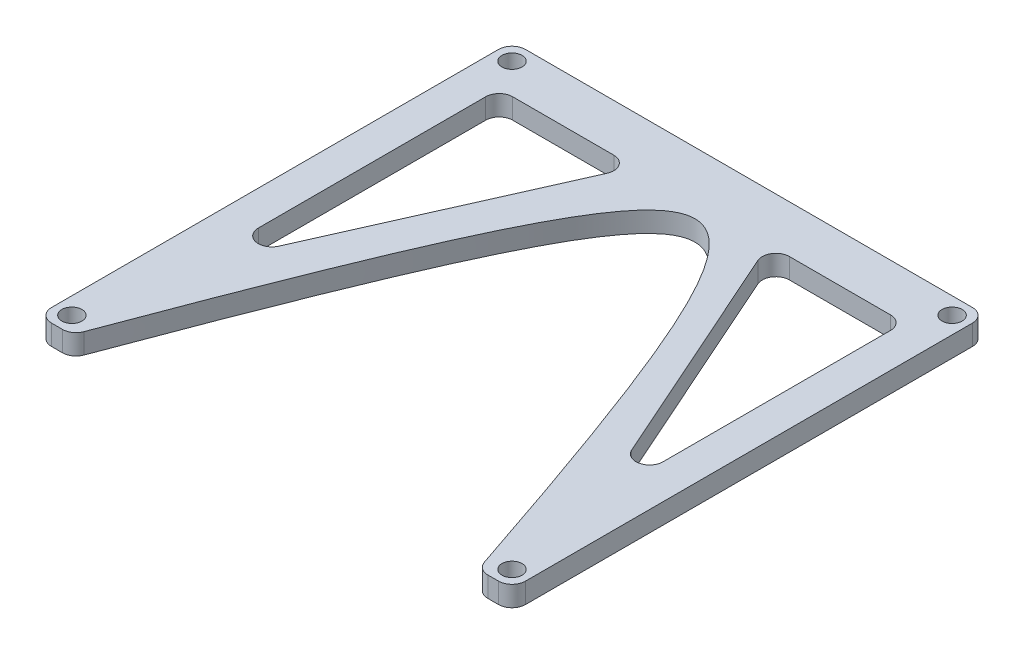
ISO-10303-21;
HEADER;
FILE_DESCRIPTION(('STEP AP214'),'2;1');
FILE_NAME('part.step','',(''),(''),'','','');
FILE_SCHEMA(('AUTOMOTIVE_DESIGN { 1 0 10303 214 1 1 1 1 }'));
ENDSEC;
DATA;
#1=APPLICATION_CONTEXT('core data for automotive mechanical design processes');
#2=APPLICATION_PROTOCOL_DEFINITION('international standard','automotive_design',2000,#1);
#3=PRODUCT_CONTEXT('',#1,'mechanical');
#4=PRODUCT('Part','Part','',(#3));
#5=PRODUCT_RELATED_PRODUCT_CATEGORY('part','',(#4));
#6=PRODUCT_DEFINITION_FORMATION('','',#4);
#7=PRODUCT_DEFINITION_CONTEXT('part definition',#1,'design');
#8=PRODUCT_DEFINITION('design','',#6,#7);
#9=PRODUCT_DEFINITION_SHAPE('','',#8);
#10=(LENGTH_UNIT() NAMED_UNIT(*) SI_UNIT(.MILLI.,.METRE.));
#11=(NAMED_UNIT(*) PLANE_ANGLE_UNIT() SI_UNIT($,.RADIAN.));
#12=(NAMED_UNIT(*) SI_UNIT($,.STERADIAN.) SOLID_ANGLE_UNIT());
#13=UNCERTAINTY_MEASURE_WITH_UNIT(LENGTH_MEASURE(1.E-05),#10,'distance_accuracy_value','');
#14=(GEOMETRIC_REPRESENTATION_CONTEXT(3) GLOBAL_UNCERTAINTY_ASSIGNED_CONTEXT((#13)) GLOBAL_UNIT_ASSIGNED_CONTEXT((#10,
#11,#12)) REPRESENTATION_CONTEXT('',''));
#15=CARTESIAN_POINT('',(0.,0.,0.));
#16=DIRECTION('',(0.,0.,1.));
#17=DIRECTION('',(1.,0.,0.));
#18=AXIS2_PLACEMENT_3D('',#15,#16,#17);
#19=CARTESIAN_POINT('',(35.,3.,35.));
#20=DIRECTION('',(0.,0.,-1.));
#21=DIRECTION('',(-1.,0.,0.));
#22=AXIS2_PLACEMENT_3D('',#19,#20,#21);
#23=PLANE('',#22);
#24=DIRECTION('',(1.,0.,0.));
#25=VECTOR('',#24,1.);
#26=CARTESIAN_POINT('',(35.,0.,35.));
#27=LINE('',#26,#25);
#28=CARTESIAN_POINT('',(31.4403017296359,0.,35.));
#29=VERTEX_POINT('',#28);
#30=CARTESIAN_POINT('',(33.,0.,35.));
#31=VERTEX_POINT('',#30);
#32=EDGE_CURVE('E223',#29,#31,#27,.T.);
#33=ORIENTED_EDGE('',*,*,#32,.T.);
#34=DIRECTION('',(0.,-1.,0.));
#35=VECTOR('',#34,1.);
#36=CARTESIAN_POINT('',(33.,3.,35.));
#37=LINE('',#36,#35);
#38=CARTESIAN_POINT('',(33.,3.,35.));
#39=VERTEX_POINT('',#38);
#40=EDGE_CURVE('E201',#31,#39,#37,.F.);
#41=ORIENTED_EDGE('',*,*,#40,.T.);
#42=DIRECTION('',(1.,0.,0.));
#43=VECTOR('',#42,1.);
#44=CARTESIAN_POINT('',(35.,3.,35.));
#45=LINE('',#44,#43);
#46=CARTESIAN_POINT('',(31.4403017296359,3.,35.));
#47=VERTEX_POINT('',#46);
#48=EDGE_CURVE('E242',#47,#39,#45,.T.);
#49=ORIENTED_EDGE('',*,*,#48,.F.);
#50=DIRECTION('',(0.,-1.,0.));
#51=VECTOR('',#50,1.);
#52=CARTESIAN_POINT('',(31.4403017296359,3.,35.));
#53=LINE('',#52,#51);
#54=EDGE_CURVE('E206',#47,#29,#53,.T.);
#55=ORIENTED_EDGE('',*,*,#54,.T.);
#56=EDGE_LOOP('',(#33,#41,#49,#55));
#57=FACE_BOUND('',#56,.T.);
#58=ADVANCED_FACE('F35',(#57),#23,.F.);
#59=CARTESIAN_POINT('',(35.,3.,-35.));
#60=DIRECTION('',(-1.,0.,0.));
#61=DIRECTION('',(0.,0.,1.));
#62=AXIS2_PLACEMENT_3D('',#59,#60,#61);
#63=PLANE('',#62);
#64=DIRECTION('',(0.,0.,-1.));
#65=VECTOR('',#64,1.);
#66=CARTESIAN_POINT('',(35.,3.,-35.));
#67=LINE('',#66,#65);
#68=CARTESIAN_POINT('',(35.,3.,33.));
#69=VERTEX_POINT('',#68);
#70=CARTESIAN_POINT('',(35.,3.,-33.));
#71=VERTEX_POINT('',#70);
#72=EDGE_CURVE('E216',#69,#71,#67,.T.);
#73=ORIENTED_EDGE('',*,*,#72,.F.);
#74=DIRECTION('',(0.,-1.,0.));
#75=VECTOR('',#74,1.);
#76=CARTESIAN_POINT('',(35.,3.,33.));
#77=LINE('',#76,#75);
#78=CARTESIAN_POINT('',(35.,0.,33.));
#79=VERTEX_POINT('',#78);
#80=EDGE_CURVE('E200',#69,#79,#77,.T.);
#81=ORIENTED_EDGE('',*,*,#80,.T.);
#82=DIRECTION('',(0.,0.,-1.));
#83=VECTOR('',#82,1.);
#84=CARTESIAN_POINT('',(35.,0.,-35.));
#85=LINE('',#84,#83);
#86=CARTESIAN_POINT('',(35.,0.,-33.));
#87=VERTEX_POINT('',#86);
#88=EDGE_CURVE('E213',#79,#87,#85,.T.);
#89=ORIENTED_EDGE('',*,*,#88,.T.);
#90=DIRECTION('',(0.,-1.,0.));
#91=VECTOR('',#90,1.);
#92=CARTESIAN_POINT('',(35.,3.,-33.));
#93=LINE('',#92,#91);
#94=EDGE_CURVE('E218',#87,#71,#93,.F.);
#95=ORIENTED_EDGE('',*,*,#94,.T.);
#96=EDGE_LOOP('',(#73,#81,#89,#95));
#97=FACE_BOUND('',#96,.T.);
#98=ADVANCED_FACE('F212',(#97),#63,.F.);
#99=CARTESIAN_POINT('',(-35.,3.,-35.));
#100=DIRECTION('',(0.,0.,1.));
#101=DIRECTION('',(1.,0.,0.));
#102=AXIS2_PLACEMENT_3D('',#99,#100,#101);
#103=PLANE('',#102);
#104=DIRECTION('',(-1.,0.,0.));
#105=VECTOR('',#104,1.);
#106=CARTESIAN_POINT('',(-35.,0.,-35.));
#107=LINE('',#106,#105);
#108=CARTESIAN_POINT('',(33.,0.,-35.));
#109=VERTEX_POINT('',#108);
#110=CARTESIAN_POINT('',(-33.,0.,-35.));
#111=VERTEX_POINT('',#110);
#112=EDGE_CURVE('E222',#109,#111,#107,.T.);
#113=ORIENTED_EDGE('',*,*,#112,.T.);
#114=DIRECTION('',(0.,-1.,0.));
#115=VECTOR('',#114,1.);
#116=CARTESIAN_POINT('',(-33.,3.,-35.));
#117=LINE('',#116,#115);
#118=CARTESIAN_POINT('',(-33.,3.,-35.));
#119=VERTEX_POINT('',#118);
#120=EDGE_CURVE('E289',#111,#119,#117,.F.);
#121=ORIENTED_EDGE('',*,*,#120,.T.);
#122=DIRECTION('',(-1.,0.,0.));
#123=VECTOR('',#122,1.);
#124=CARTESIAN_POINT('',(-35.,3.,-35.));
#125=LINE('',#124,#123);
#126=CARTESIAN_POINT('',(33.,3.,-35.));
#127=VERTEX_POINT('',#126);
#128=EDGE_CURVE('E413',#127,#119,#125,.T.);
#129=ORIENTED_EDGE('',*,*,#128,.F.);
#130=DIRECTION('',(0.,-1.,0.));
#131=VECTOR('',#130,1.);
#132=CARTESIAN_POINT('',(33.,3.,-35.));
#133=LINE('',#132,#131);
#134=EDGE_CURVE('E286',#127,#109,#133,.T.);
#135=ORIENTED_EDGE('',*,*,#134,.T.);
#136=EDGE_LOOP('',(#113,#121,#129,#135));
#137=FACE_BOUND('',#136,.T.);
#138=ADVANCED_FACE('F442',(#137),#103,.F.);
#139=CARTESIAN_POINT('',(-35.,3.,-35.));
#140=DIRECTION('',(1.,0.,0.));
#141=DIRECTION('',(0.,0.,-1.));
#142=AXIS2_PLACEMENT_3D('',#139,#140,#141);
#143=PLANE('',#142);
#144=DIRECTION('',(0.,0.,1.));
#145=VECTOR('',#144,1.);
#146=CARTESIAN_POINT('',(-35.,0.,-35.));
#147=LINE('',#146,#145);
#148=CARTESIAN_POINT('',(-35.,0.,-33.));
#149=VERTEX_POINT('',#148);
#150=CARTESIAN_POINT('',(-35.,0.,33.));
#151=VERTEX_POINT('',#150);
#152=EDGE_CURVE('E226',#149,#151,#147,.T.);
#153=ORIENTED_EDGE('',*,*,#152,.T.);
#154=DIRECTION('',(0.,-1.,0.));
#155=VECTOR('',#154,1.);
#156=CARTESIAN_POINT('',(-35.,3.,33.));
#157=LINE('',#156,#155);
#158=CARTESIAN_POINT('',(-35.,3.,33.));
#159=VERTEX_POINT('',#158);
#160=EDGE_CURVE('E284',#151,#159,#157,.F.);
#161=ORIENTED_EDGE('',*,*,#160,.T.);
#162=DIRECTION('',(0.,0.,1.));
#163=VECTOR('',#162,1.);
#164=CARTESIAN_POINT('',(-35.,3.,-35.));
#165=LINE('',#164,#163);
#166=CARTESIAN_POINT('',(-35.,3.,-33.));
#167=VERTEX_POINT('',#166);
#168=EDGE_CURVE('E416',#167,#159,#165,.T.);
#169=ORIENTED_EDGE('',*,*,#168,.F.);
#170=DIRECTION('',(0.,-1.,0.));
#171=VECTOR('',#170,1.);
#172=CARTESIAN_POINT('',(-35.,3.,-33.));
#173=LINE('',#172,#171);
#174=EDGE_CURVE('E281',#167,#149,#173,.T.);
#175=ORIENTED_EDGE('',*,*,#174,.T.);
#176=EDGE_LOOP('',(#153,#161,#169,#175));
#177=FACE_BOUND('',#176,.T.);
#178=ADVANCED_FACE('F438',(#177),#143,.F.);
#179=CARTESIAN_POINT('',(-30.,3.,35.));
#180=DIRECTION('',(0.,0.,-1.));
#181=DIRECTION('',(-1.,0.,0.));
#182=AXIS2_PLACEMENT_3D('',#179,#180,#181);
#183=PLANE('',#182);
#184=DIRECTION('',(1.,0.,0.));
#185=VECTOR('',#184,1.);
#186=CARTESIAN_POINT('',(-30.,0.,35.));
#187=LINE('',#186,#185);
#188=CARTESIAN_POINT('',(-33.,0.,35.));
#189=VERTEX_POINT('',#188);
#190=CARTESIAN_POINT('',(-31.3900685120707,0.,35.));
#191=VERTEX_POINT('',#190);
#192=EDGE_CURVE('E234',#189,#191,#187,.T.);
#193=ORIENTED_EDGE('',*,*,#192,.T.);
#194=DIRECTION('',(0.,-1.,0.));
#195=VECTOR('',#194,1.);
#196=CARTESIAN_POINT('',(-31.3900685120707,3.,35.));
#197=LINE('',#196,#195);
#198=CARTESIAN_POINT('',(-31.3900685120707,3.,35.));
#199=VERTEX_POINT('',#198);
#200=EDGE_CURVE('E279',#191,#199,#197,.F.);
#201=ORIENTED_EDGE('',*,*,#200,.T.);
#202=DIRECTION('',(1.,0.,0.));
#203=VECTOR('',#202,1.);
#204=CARTESIAN_POINT('',(-30.,3.,35.));
#205=LINE('',#204,#203);
#206=CARTESIAN_POINT('',(-33.,3.,35.));
#207=VERTEX_POINT('',#206);
#208=EDGE_CURVE('E419',#207,#199,#205,.T.);
#209=ORIENTED_EDGE('',*,*,#208,.F.);
#210=DIRECTION('',(0.,-1.,0.));
#211=VECTOR('',#210,1.);
#212=CARTESIAN_POINT('',(-33.,3.,35.));
#213=LINE('',#212,#211);
#214=EDGE_CURVE('E276',#207,#189,#213,.T.);
#215=ORIENTED_EDGE('',*,*,#214,.T.);
#216=EDGE_LOOP('',(#193,#201,#209,#215));
#217=FACE_BOUND('',#216,.T.);
#218=ADVANCED_FACE('F433',(#217),#183,.F.);
#219=CARTESIAN_POINT('',(-30.,3.,35.));
#220=CARTESIAN_POINT('',(1.60249834950404,3.,-50.0815307085895));
#221=CARTESIAN_POINT('',(30.,3.,35.));
#222=(BOUNDED_CURVE() B_SPLINE_CURVE(2,(#219,#220,#221),.UNSPECIFIED.,.F.,
.F.) B_SPLINE_CURVE_WITH_KNOTS((3,3),(0.,1.),
.UNSPECIFIED.) CURVE() GEOMETRIC_REPRESENTATION_ITEM() RATIONAL_B_SPLINE_CURVE((1.,
2.51295867918572,1.)) REPRESENTATION_ITEM(''));
#223=DIRECTION('',(0.,-1.,0.));
#224=VECTOR('',#223,1.);
#225=SURFACE_OF_LINEAR_EXTRUSION('',#222,#224);
#226=CARTESIAN_POINT('',(-30.,0.,35.));
#227=CARTESIAN_POINT('',(1.60249834950404,0.,-50.0815307085895));
#228=CARTESIAN_POINT('',(30.,0.,35.));
#229=(BOUNDED_CURVE() B_SPLINE_CURVE(2,(#226,#227,#228),.UNSPECIFIED.,.F.,
.F.) B_SPLINE_CURVE_WITH_KNOTS((3,3),(0.,1.),
.UNSPECIFIED.) CURVE() GEOMETRIC_REPRESENTATION_ITEM() RATIONAL_B_SPLINE_CURVE((1.,
2.51295867918572,1.)) REPRESENTATION_ITEM(''));
#230=CARTESIAN_POINT('',(-29.515759256809,0.,33.6978286434652));
#231=VERTEX_POINT('',#230);
#232=CARTESIAN_POINT('',(29.5437062469228,0.,33.6347641884607));
#233=VERTEX_POINT('',#232);
#234=EDGE_CURVE('E237',#231,#233,#229,.T.);
#235=ORIENTED_EDGE('',*,*,#234,.T.);
#236=DIRECTION('',(0.,-1.,0.));
#237=VECTOR('',#236,1.);
#238=CARTESIAN_POINT('',(29.5437062469228,0.,33.6347641884607));
#239=LINE('',#238,#237);
#240=CARTESIAN_POINT('',(29.5437062469228,3.,33.6347641884607));
#241=VERTEX_POINT('',#240);
#242=EDGE_CURVE('E274',#233,#241,#239,.F.);
#243=ORIENTED_EDGE('',*,*,#242,.T.);
#244=CARTESIAN_POINT('',(-29.515759256809,3.,33.6978286434652));
#245=VERTEX_POINT('',#244);
#246=EDGE_CURVE('E246',#245,#241,#222,.T.);
#247=ORIENTED_EDGE('',*,*,#246,.F.);
#248=DIRECTION('',(0.,-1.,0.));
#249=VECTOR('',#248,1.);
#250=CARTESIAN_POINT('',(-29.515759256809,3.,33.6978286434651));
#251=LINE('',#250,#249);
#252=EDGE_CURVE('E271',#245,#231,#251,.T.);
#253=ORIENTED_EDGE('',*,*,#252,.T.);
#254=EDGE_LOOP('',(#235,#243,#247,#253));
#255=FACE_BOUND('',#254,.T.);
#256=ADVANCED_FACE('F429',(#255),#225,.F.);
#257=CARTESIAN_POINT('',(1.14633062996926,3.,-25.8621935405501));
#258=DIRECTION('',(0.,1.,0.));
#259=DIRECTION('',(0.,0.,1.));
#260=AXIS2_PLACEMENT_3D('',#257,#258,#259);
#261=PLANE('',#260);
#262=DIRECTION('',(0.406138466053448,0.,-0.913811548620257));
#263=VECTOR('',#262,1.);
#264=CARTESIAN_POINT('',(-9.89161932674733,3.,-28.));
#265=LINE('',#264,#263);
#266=CARTESIAN_POINT('',(-26.0639962295068,3.,8.38784803120884));
#267=VERTEX_POINT('',#266);
#268=CARTESIAN_POINT('',(-11.1415201854615,3.,-25.1877230678931));
#269=VERTEX_POINT('',#268);
#270=EDGE_CURVE('E345',#267,#269,#265,.T.);
#271=ORIENTED_EDGE('',*,*,#270,.F.);
#272=CARTESIAN_POINT('',(-27.8916193267473,3.,7.57557109910195));
#273=DIRECTION('',(0.,1.,0.));
#274=DIRECTION('',(0.,0.,1.));
#275=AXIS2_PLACEMENT_3D('',#272,#273,#274);
#276=CIRCLE('',#275,2.);
#277=CARTESIAN_POINT('',(-29.8916193267473,3.,7.57557109910195));
#278=VERTEX_POINT('',#277);
#279=EDGE_CURVE('E332',#267,#278,#276,.F.);
#280=ORIENTED_EDGE('',*,*,#279,.T.);
#281=DIRECTION('',(0.,0.,1.));
#282=VECTOR('',#281,1.);
#283=CARTESIAN_POINT('',(-29.8916193267473,3.,17.));
#284=LINE('',#283,#282);
#285=CARTESIAN_POINT('',(-29.8916193267473,3.,-26.));
#286=VERTEX_POINT('',#285);
#287=EDGE_CURVE('E365',#286,#278,#284,.T.);
#288=ORIENTED_EDGE('',*,*,#287,.F.);
#289=CARTESIAN_POINT('',(-27.8916193267473,3.,-26.));
#290=DIRECTION('',(0.,1.,0.));
#291=DIRECTION('',(0.,0.,1.));
#292=AXIS2_PLACEMENT_3D('',#289,#290,#291);
#293=CIRCLE('',#292,2.);
#294=CARTESIAN_POINT('',(-27.8916193267473,3.,-28.));
#295=VERTEX_POINT('',#294);
#296=EDGE_CURVE('E336',#286,#295,#293,.F.);
#297=ORIENTED_EDGE('',*,*,#296,.T.);
#298=DIRECTION('',(-1.,0.,0.));
#299=VECTOR('',#298,1.);
#300=CARTESIAN_POINT('',(-29.8916193267473,3.,-28.));
#301=LINE('',#300,#299);
#302=CARTESIAN_POINT('',(-12.969143282702,3.,-28.));
#303=VERTEX_POINT('',#302);
#304=EDGE_CURVE('E346',#303,#295,#301,.T.);
#305=ORIENTED_EDGE('',*,*,#304,.F.);
#306=CARTESIAN_POINT('',(-12.969143282702,3.,-26.));
#307=DIRECTION('',(0.,1.,0.));
#308=DIRECTION('',(0.,0.,1.));
#309=AXIS2_PLACEMENT_3D('',#306,#307,#308);
#310=CIRCLE('',#309,2.);
#311=EDGE_CURVE('E43',#303,#269,#310,.F.);
#312=ORIENTED_EDGE('',*,*,#311,.T.);
#313=EDGE_LOOP('',(#271,#280,#288,#297,#305,#312));
#314=FACE_BOUND('',#313,.T.);
#315=DIRECTION('',(0.406138466053448,0.,0.913811548620257));
#316=VECTOR('',#315,1.);
#317=CARTESIAN_POINT('',(9.89161932674734,3.,-28.));
#318=LINE('',#317,#316);
#319=CARTESIAN_POINT('',(11.1415201854615,3.,-25.1877230678931));
#320=VERTEX_POINT('',#319);
#321=CARTESIAN_POINT('',(26.0639962295068,3.,8.38784803120883));
#322=VERTEX_POINT('',#321);
#323=EDGE_CURVE('E380',#320,#322,#318,.T.);
#324=ORIENTED_EDGE('',*,*,#323,.F.);
#325=CARTESIAN_POINT('',(12.969143282702,3.,-26.));
#326=DIRECTION('',(0.,1.,0.));
#327=DIRECTION('',(0.,0.,1.));
#328=AXIS2_PLACEMENT_3D('',#325,#326,#327);
#329=CIRCLE('',#328,2.);
#330=CARTESIAN_POINT('',(12.969143282702,3.,-28.));
#331=VERTEX_POINT('',#330);
#332=EDGE_CURVE('E324',#320,#331,#329,.F.);
#333=ORIENTED_EDGE('',*,*,#332,.T.);
#334=DIRECTION('',(-1.,0.,0.));
#335=VECTOR('',#334,1.);
#336=CARTESIAN_POINT('',(29.8916193267473,3.,-28.));
#337=LINE('',#336,#335);
#338=CARTESIAN_POINT('',(27.8916193267473,3.,-28.));
#339=VERTEX_POINT('',#338);
#340=EDGE_CURVE('E375',#339,#331,#337,.T.);
#341=ORIENTED_EDGE('',*,*,#340,.F.);
#342=CARTESIAN_POINT('',(27.8916193267473,3.,-26.));
#343=DIRECTION('',(0.,1.,0.));
#344=DIRECTION('',(0.,0.,1.));
#345=AXIS2_PLACEMENT_3D('',#342,#343,#344);
#346=CIRCLE('',#345,2.);
#347=CARTESIAN_POINT('',(29.8916193267473,3.,-26.));
#348=VERTEX_POINT('',#347);
#349=EDGE_CURVE('E320',#339,#348,#346,.F.);
#350=ORIENTED_EDGE('',*,*,#349,.T.);
#351=DIRECTION('',(0.,0.,-1.));
#352=VECTOR('',#351,1.);
#353=CARTESIAN_POINT('',(29.8916193267473,3.,17.));
#354=LINE('',#353,#352);
#355=CARTESIAN_POINT('',(29.8916193267473,3.,7.57557109910194));
#356=VERTEX_POINT('',#355);
#357=EDGE_CURVE('E383',#356,#348,#354,.T.);
#358=ORIENTED_EDGE('',*,*,#357,.F.);
#359=CARTESIAN_POINT('',(27.8916193267473,3.,7.57557109910193));
#360=DIRECTION('',(0.,1.,0.));
#361=DIRECTION('',(0.,0.,1.));
#362=AXIS2_PLACEMENT_3D('',#359,#360,#361);
#363=CIRCLE('',#362,2.);
#364=EDGE_CURVE('E328',#356,#322,#363,.F.);
#365=ORIENTED_EDGE('',*,*,#364,.T.);
#366=EDGE_LOOP('',(#324,#333,#341,#350,#358,#365));
#367=FACE_BOUND('',#366,.T.);
#368=CARTESIAN_POINT('',(-32.4999999999993,3.,32.5));
#369=DIRECTION('',(0.,1.,0.));
#370=DIRECTION('',(0.,0.,1.));
#371=AXIS2_PLACEMENT_3D('',#368,#369,#370);
#372=CIRCLE('',#371,1.48813384559825);
#373=CARTESIAN_POINT('',(-32.4999999999993,3.,33.9881338455983));
#374=VERTEX_POINT('',#373);
#375=EDGE_CURVE('E363',#374,#374,#372,.T.);
#376=ORIENTED_EDGE('',*,*,#375,.F.);
#377=EDGE_LOOP('',(#376));
#378=FACE_BOUND('',#377,.T.);
#379=CARTESIAN_POINT('',(32.5000000000007,3.,32.5));
#380=DIRECTION('',(0.,1.,0.));
#381=DIRECTION('',(0.,0.,1.));
#382=AXIS2_PLACEMENT_3D('',#379,#380,#381);
#383=CIRCLE('',#382,1.48813384559825);
#384=CARTESIAN_POINT('',(32.5000000000007,3.,33.9881338455983));
#385=VERTEX_POINT('',#384);
#386=EDGE_CURVE('E398',#385,#385,#383,.T.);
#387=ORIENTED_EDGE('',*,*,#386,.F.);
#388=EDGE_LOOP('',(#387));
#389=FACE_BOUND('',#388,.T.);
#390=CARTESIAN_POINT('',(32.5,3.,-32.5));
#391=DIRECTION('',(0.,1.,0.));
#392=DIRECTION('',(0.,0.,1.));
#393=AXIS2_PLACEMENT_3D('',#390,#391,#392);
#394=CIRCLE('',#393,1.48813384559825);
#395=CARTESIAN_POINT('',(32.5,3.,-31.0118661544018));
#396=VERTEX_POINT('',#395);
#397=EDGE_CURVE('E392',#396,#396,#394,.T.);
#398=ORIENTED_EDGE('',*,*,#397,.F.);
#399=EDGE_LOOP('',(#398));
#400=FACE_BOUND('',#399,.T.);
#401=CARTESIAN_POINT('',(-32.5,3.,-32.5));
#402=DIRECTION('',(0.,1.,0.));
#403=DIRECTION('',(0.,0.,1.));
#404=AXIS2_PLACEMENT_3D('',#401,#402,#403);
#405=CIRCLE('',#404,1.48813384559825);
#406=CARTESIAN_POINT('',(-32.5,3.,-31.0118661544018));
#407=VERTEX_POINT('',#406);
#408=EDGE_CURVE('E391',#407,#407,#405,.T.);
#409=ORIENTED_EDGE('',*,*,#408,.F.);
#410=EDGE_LOOP('',(#409));
#411=FACE_BOUND('',#410,.T.);
#412=ORIENTED_EDGE('',*,*,#48,.T.);
#413=CARTESIAN_POINT('',(33.,3.,33.));
#414=DIRECTION('',(0.,1.,0.));
#415=DIRECTION('',(0.,0.,1.));
#416=AXIS2_PLACEMENT_3D('',#413,#414,#415);
#417=CIRCLE('',#416,2.);
#418=EDGE_CURVE('E269',#39,#69,#417,.T.);
#419=ORIENTED_EDGE('',*,*,#418,.T.);
#420=ORIENTED_EDGE('',*,*,#72,.T.);
#421=CARTESIAN_POINT('',(33.,3.,-33.));
#422=DIRECTION('',(0.,1.,0.));
#423=DIRECTION('',(0.,0.,1.));
#424=AXIS2_PLACEMENT_3D('',#421,#422,#423);
#425=CIRCLE('',#424,2.);
#426=EDGE_CURVE('E259',#71,#127,#425,.T.);
#427=ORIENTED_EDGE('',*,*,#426,.T.);
#428=ORIENTED_EDGE('',*,*,#128,.T.);
#429=CARTESIAN_POINT('',(-33.,3.,-33.));
#430=DIRECTION('',(0.,1.,0.));
#431=DIRECTION('',(0.,0.,1.));
#432=AXIS2_PLACEMENT_3D('',#429,#430,#431);
#433=CIRCLE('',#432,2.);
#434=EDGE_CURVE('E261',#119,#167,#433,.T.);
#435=ORIENTED_EDGE('',*,*,#434,.T.);
#436=ORIENTED_EDGE('',*,*,#168,.T.);
#437=CARTESIAN_POINT('',(-33.,3.,33.));
#438=DIRECTION('',(0.,1.,0.));
#439=DIRECTION('',(0.,0.,1.));
#440=AXIS2_PLACEMENT_3D('',#437,#438,#439);
#441=CIRCLE('',#440,2.);
#442=EDGE_CURVE('E263',#159,#207,#441,.T.);
#443=ORIENTED_EDGE('',*,*,#442,.T.);
#444=ORIENTED_EDGE('',*,*,#208,.T.);
#445=CARTESIAN_POINT('',(-31.3900685120707,3.,33.));
#446=DIRECTION('',(0.,1.,0.));
#447=DIRECTION('',(0.,0.,1.));
#448=AXIS2_PLACEMENT_3D('',#445,#446,#447);
#449=CIRCLE('',#448,2.);
#450=EDGE_CURVE('E265',#199,#245,#449,.T.);
#451=ORIENTED_EDGE('',*,*,#450,.T.);
#452=ORIENTED_EDGE('',*,*,#246,.T.);
#453=CARTESIAN_POINT('',(31.4403017296359,3.,33.0000000000001));
#454=DIRECTION('',(0.,1.,0.));
#455=DIRECTION('',(0.,0.,1.));
#456=AXIS2_PLACEMENT_3D('',#453,#454,#455);
#457=CIRCLE('',#456,2.);
#458=EDGE_CURVE('E267',#241,#47,#457,.T.);
#459=ORIENTED_EDGE('',*,*,#458,.T.);
#460=EDGE_LOOP('',(#412,#419,#420,#427,#428,#435,#436,#443,#444,#451,#452,#459));
#461=FACE_BOUND('',#460,.T.);
#462=ADVANCED_FACE('F343',(#314,#367,#378,#389,#400,#411,#461),#261,.T.);
#463=CARTESIAN_POINT('',(1.14633062996926,0.,-25.8621935405501));
#464=DIRECTION('',(0.,1.,0.));
#465=DIRECTION('',(0.,0.,1.));
#466=AXIS2_PLACEMENT_3D('',#463,#464,#465);
#467=PLANE('',#466);
#468=DIRECTION('',(-1.,0.,0.));
#469=VECTOR('',#468,1.);
#470=CARTESIAN_POINT('',(-29.8916193267473,0.,-28.));
#471=LINE('',#470,#469);
#472=CARTESIAN_POINT('',(-12.969143282702,0.,-28.));
#473=VERTEX_POINT('',#472);
#474=CARTESIAN_POINT('',(-27.8916193267473,0.,-28.));
#475=VERTEX_POINT('',#474);
#476=EDGE_CURVE('E357',#473,#475,#471,.T.);
#477=ORIENTED_EDGE('',*,*,#476,.T.);
#478=CARTESIAN_POINT('',(-27.8916193267473,0.,-26.));
#479=DIRECTION('',(0.,1.,0.));
#480=DIRECTION('',(0.,0.,1.));
#481=AXIS2_PLACEMENT_3D('',#478,#479,#480);
#482=CIRCLE('',#481,2.);
#483=CARTESIAN_POINT('',(-29.8916193267473,0.,-26.));
#484=VERTEX_POINT('',#483);
#485=EDGE_CURVE('E338',#475,#484,#482,.T.);
#486=ORIENTED_EDGE('',*,*,#485,.T.);
#487=DIRECTION('',(0.,0.,1.));
#488=VECTOR('',#487,1.);
#489=CARTESIAN_POINT('',(-29.8916193267473,0.,17.));
#490=LINE('',#489,#488);
#491=CARTESIAN_POINT('',(-29.8916193267473,0.,7.57557109910195));
#492=VERTEX_POINT('',#491);
#493=EDGE_CURVE('E359',#484,#492,#490,.T.);
#494=ORIENTED_EDGE('',*,*,#493,.T.);
#495=CARTESIAN_POINT('',(-27.8916193267473,0.,7.57557109910195));
#496=DIRECTION('',(0.,1.,0.));
#497=DIRECTION('',(0.,0.,1.));
#498=AXIS2_PLACEMENT_3D('',#495,#496,#497);
#499=CIRCLE('',#498,2.);
#500=CARTESIAN_POINT('',(-26.0639962295068,0.,8.38784803120884));
#501=VERTEX_POINT('',#500);
#502=EDGE_CURVE('E334',#492,#501,#499,.T.);
#503=ORIENTED_EDGE('',*,*,#502,.T.);
#504=DIRECTION('',(0.406138466053448,0.,-0.913811548620257));
#505=VECTOR('',#504,1.);
#506=CARTESIAN_POINT('',(-9.89161932674733,0.,-28.));
#507=LINE('',#506,#505);
#508=CARTESIAN_POINT('',(-11.1415201854615,0.,-25.1877230678931));
#509=VERTEX_POINT('',#508);
#510=EDGE_CURVE('E360',#501,#509,#507,.T.);
#511=ORIENTED_EDGE('',*,*,#510,.T.);
#512=CARTESIAN_POINT('',(-12.969143282702,0.,-26.));
#513=DIRECTION('',(0.,1.,0.));
#514=DIRECTION('',(0.,0.,1.));
#515=AXIS2_PLACEMENT_3D('',#512,#513,#514);
#516=CIRCLE('',#515,2.);
#517=EDGE_CURVE('E11',#509,#473,#516,.T.);
#518=ORIENTED_EDGE('',*,*,#517,.T.);
#519=EDGE_LOOP('',(#477,#486,#494,#503,#511,#518));
#520=FACE_BOUND('',#519,.T.);
#521=DIRECTION('',(0.,0.,-1.));
#522=VECTOR('',#521,1.);
#523=CARTESIAN_POINT('',(29.8916193267473,0.,17.));
#524=LINE('',#523,#522);
#525=CARTESIAN_POINT('',(29.8916193267473,0.,7.57557109910194));
#526=VERTEX_POINT('',#525);
#527=CARTESIAN_POINT('',(29.8916193267473,0.,-26.));
#528=VERTEX_POINT('',#527);
#529=EDGE_CURVE('E374',#526,#528,#524,.T.);
#530=ORIENTED_EDGE('',*,*,#529,.T.);
#531=CARTESIAN_POINT('',(27.8916193267473,0.,-26.));
#532=DIRECTION('',(0.,1.,0.));
#533=DIRECTION('',(0.,0.,1.));
#534=AXIS2_PLACEMENT_3D('',#531,#532,#533);
#535=CIRCLE('',#534,2.);
#536=CARTESIAN_POINT('',(27.8916193267473,0.,-28.));
#537=VERTEX_POINT('',#536);
#538=EDGE_CURVE('E322',#528,#537,#535,.T.);
#539=ORIENTED_EDGE('',*,*,#538,.T.);
#540=DIRECTION('',(-1.,0.,0.));
#541=VECTOR('',#540,1.);
#542=CARTESIAN_POINT('',(29.8916193267473,0.,-28.));
#543=LINE('',#542,#541);
#544=CARTESIAN_POINT('',(12.969143282702,0.,-28.));
#545=VERTEX_POINT('',#544);
#546=EDGE_CURVE('E354',#537,#545,#543,.T.);
#547=ORIENTED_EDGE('',*,*,#546,.T.);
#548=CARTESIAN_POINT('',(12.969143282702,0.,-26.));
#549=DIRECTION('',(0.,1.,0.));
#550=DIRECTION('',(0.,0.,1.));
#551=AXIS2_PLACEMENT_3D('',#548,#549,#550);
#552=CIRCLE('',#551,2.);
#553=CARTESIAN_POINT('',(11.1415201854615,0.,-25.1877230678931));
#554=VERTEX_POINT('',#553);
#555=EDGE_CURVE('E326',#545,#554,#552,.T.);
#556=ORIENTED_EDGE('',*,*,#555,.T.);
#557=DIRECTION('',(0.406138466053448,0.,0.913811548620257));
#558=VECTOR('',#557,1.);
#559=CARTESIAN_POINT('',(9.89161932674734,0.,-28.));
#560=LINE('',#559,#558);
#561=CARTESIAN_POINT('',(26.0639962295068,0.,8.38784803120883));
#562=VERTEX_POINT('',#561);
#563=EDGE_CURVE('E371',#554,#562,#560,.T.);
#564=ORIENTED_EDGE('',*,*,#563,.T.);
#565=CARTESIAN_POINT('',(27.8916193267473,0.,7.57557109910193));
#566=DIRECTION('',(0.,1.,0.));
#567=DIRECTION('',(0.,0.,1.));
#568=AXIS2_PLACEMENT_3D('',#565,#566,#567);
#569=CIRCLE('',#568,2.);
#570=EDGE_CURVE('E330',#562,#526,#569,.T.);
#571=ORIENTED_EDGE('',*,*,#570,.T.);
#572=EDGE_LOOP('',(#530,#539,#547,#556,#564,#571));
#573=FACE_BOUND('',#572,.T.);
#574=CARTESIAN_POINT('',(-32.4999999999993,0.,32.5));
#575=DIRECTION('',(0.,1.,0.));
#576=DIRECTION('',(0.,0.,1.));
#577=AXIS2_PLACEMENT_3D('',#574,#575,#576);
#578=CIRCLE('',#577,1.48813384559825);
#579=CARTESIAN_POINT('',(-32.4999999999993,0.,33.9881338455983));
#580=VERTEX_POINT('',#579);
#581=EDGE_CURVE('E401',#580,#580,#578,.T.);
#582=ORIENTED_EDGE('',*,*,#581,.T.);
#583=EDGE_LOOP('',(#582));
#584=FACE_BOUND('',#583,.T.);
#585=CARTESIAN_POINT('',(32.5000000000007,0.,32.5));
#586=DIRECTION('',(0.,1.,0.));
#587=DIRECTION('',(0.,0.,1.));
#588=AXIS2_PLACEMENT_3D('',#585,#586,#587);
#589=CIRCLE('',#588,1.48813384559825);
#590=CARTESIAN_POINT('',(32.5000000000007,0.,33.9881338455983));
#591=VERTEX_POINT('',#590);
#592=EDGE_CURVE('E395',#591,#591,#589,.T.);
#593=ORIENTED_EDGE('',*,*,#592,.T.);
#594=EDGE_LOOP('',(#593));
#595=FACE_BOUND('',#594,.T.);
#596=CARTESIAN_POINT('',(32.5,0.,-32.5));
#597=DIRECTION('',(0.,1.,0.));
#598=DIRECTION('',(0.,0.,1.));
#599=AXIS2_PLACEMENT_3D('',#596,#597,#598);
#600=CIRCLE('',#599,1.48813384559825);
#601=CARTESIAN_POINT('',(32.5,0.,-31.0118661544018));
#602=VERTEX_POINT('',#601);
#603=EDGE_CURVE('E388',#602,#602,#600,.T.);
#604=ORIENTED_EDGE('',*,*,#603,.T.);
#605=EDGE_LOOP('',(#604));
#606=FACE_BOUND('',#605,.T.);
#607=CARTESIAN_POINT('',(-32.5,0.,-32.5));
#608=DIRECTION('',(0.,1.,0.));
#609=DIRECTION('',(0.,0.,1.));
#610=AXIS2_PLACEMENT_3D('',#607,#608,#609);
#611=CIRCLE('',#610,1.48813384559825);
#612=CARTESIAN_POINT('',(-32.5,0.,-31.0118661544018));
#613=VERTEX_POINT('',#612);
#614=EDGE_CURVE('E228',#613,#613,#611,.T.);
#615=ORIENTED_EDGE('',*,*,#614,.T.);
#616=EDGE_LOOP('',(#615));
#617=FACE_BOUND('',#616,.T.);
#618=ORIENTED_EDGE('',*,*,#88,.F.);
#619=CARTESIAN_POINT('',(33.,0.,33.));
#620=DIRECTION('',(0.,1.,0.));
#621=DIRECTION('',(0.,0.,1.));
#622=AXIS2_PLACEMENT_3D('',#619,#620,#621);
#623=CIRCLE('',#622,2.);
#624=EDGE_CURVE('E196',#79,#31,#623,.F.);
#625=ORIENTED_EDGE('',*,*,#624,.T.);
#626=ORIENTED_EDGE('',*,*,#32,.F.);
#627=CARTESIAN_POINT('',(31.4403017296359,0.,33.0000000000001));
#628=DIRECTION('',(0.,1.,0.));
#629=DIRECTION('',(0.,0.,1.));
#630=AXIS2_PLACEMENT_3D('',#627,#628,#629);
#631=CIRCLE('',#630,2.);
#632=EDGE_CURVE('E207',#29,#233,#631,.F.);
#633=ORIENTED_EDGE('',*,*,#632,.T.);
#634=ORIENTED_EDGE('',*,*,#234,.F.);
#635=CARTESIAN_POINT('',(-31.3900685120707,0.,33.));
#636=DIRECTION('',(0.,1.,0.));
#637=DIRECTION('',(0.,0.,1.));
#638=AXIS2_PLACEMENT_3D('',#635,#636,#637);
#639=CIRCLE('',#638,2.);
#640=EDGE_CURVE('E253',#231,#191,#639,.F.);
#641=ORIENTED_EDGE('',*,*,#640,.T.);
#642=ORIENTED_EDGE('',*,*,#192,.F.);
#643=CARTESIAN_POINT('',(-33.,0.,33.));
#644=DIRECTION('',(0.,1.,0.));
#645=DIRECTION('',(0.,0.,1.));
#646=AXIS2_PLACEMENT_3D('',#643,#644,#645);
#647=CIRCLE('',#646,2.);
#648=EDGE_CURVE('E251',#189,#151,#647,.F.);
#649=ORIENTED_EDGE('',*,*,#648,.T.);
#650=ORIENTED_EDGE('',*,*,#152,.F.);
#651=CARTESIAN_POINT('',(-33.,0.,-33.));
#652=DIRECTION('',(0.,1.,0.));
#653=DIRECTION('',(0.,0.,1.));
#654=AXIS2_PLACEMENT_3D('',#651,#652,#653);
#655=CIRCLE('',#654,2.);
#656=EDGE_CURVE('E249',#149,#111,#655,.F.);
#657=ORIENTED_EDGE('',*,*,#656,.T.);
#658=ORIENTED_EDGE('',*,*,#112,.F.);
#659=CARTESIAN_POINT('',(33.,0.,-33.));
#660=DIRECTION('',(0.,1.,0.));
#661=DIRECTION('',(0.,0.,1.));
#662=AXIS2_PLACEMENT_3D('',#659,#660,#661);
#663=CIRCLE('',#662,2.);
#664=EDGE_CURVE('E217',#109,#87,#663,.F.);
#665=ORIENTED_EDGE('',*,*,#664,.T.);
#666=EDGE_LOOP('',(#618,#625,#626,#633,#634,#641,#642,#649,#650,#657,#658,#665));
#667=FACE_BOUND('',#666,.T.);
#668=ADVANCED_FACE('F220',(#520,#573,#584,#595,#606,#617,#667),#467,.F.);
#669=CARTESIAN_POINT('',(-32.5,0.,-32.5));
#670=DIRECTION('',(0.,1.,0.));
#671=DIRECTION('',(0.,0.,1.));
#672=AXIS2_PLACEMENT_3D('',#669,#670,#671);
#673=CYLINDRICAL_SURFACE('',#672,1.48813384559825);
#674=ORIENTED_EDGE('',*,*,#614,.F.);
#675=EDGE_LOOP('',(#674));
#676=FACE_BOUND('',#675,.T.);
#677=ORIENTED_EDGE('',*,*,#408,.T.);
#678=EDGE_LOOP('',(#677));
#679=FACE_BOUND('',#678,.T.);
#680=ADVANCED_FACE('F529',(#676,#679),#673,.F.);
#681=CARTESIAN_POINT('',(32.5,0.,-32.5));
#682=DIRECTION('',(0.,1.,0.));
#683=DIRECTION('',(0.,0.,1.));
#684=AXIS2_PLACEMENT_3D('',#681,#682,#683);
#685=CYLINDRICAL_SURFACE('',#684,1.48813384559825);
#686=ORIENTED_EDGE('',*,*,#603,.F.);
#687=EDGE_LOOP('',(#686));
#688=FACE_BOUND('',#687,.T.);
#689=ORIENTED_EDGE('',*,*,#397,.T.);
#690=EDGE_LOOP('',(#689));
#691=FACE_BOUND('',#690,.T.);
#692=ADVANCED_FACE('F525',(#688,#691),#685,.F.);
#693=CARTESIAN_POINT('',(32.5000000000007,0.,32.5));
#694=DIRECTION('',(0.,1.,0.));
#695=DIRECTION('',(0.,0.,1.));
#696=AXIS2_PLACEMENT_3D('',#693,#694,#695);
#697=CYLINDRICAL_SURFACE('',#696,1.48813384559825);
#698=ORIENTED_EDGE('',*,*,#592,.F.);
#699=EDGE_LOOP('',(#698));
#700=FACE_BOUND('',#699,.T.);
#701=ORIENTED_EDGE('',*,*,#386,.T.);
#702=EDGE_LOOP('',(#701));
#703=FACE_BOUND('',#702,.T.);
#704=ADVANCED_FACE('F528',(#700,#703),#697,.F.);
#705=CARTESIAN_POINT('',(-32.4999999999993,0.,32.5));
#706=DIRECTION('',(0.,1.,0.));
#707=DIRECTION('',(0.,0.,1.));
#708=AXIS2_PLACEMENT_3D('',#705,#706,#707);
#709=CYLINDRICAL_SURFACE('',#708,1.48813384559825);
#710=ORIENTED_EDGE('',*,*,#581,.F.);
#711=EDGE_LOOP('',(#710));
#712=FACE_BOUND('',#711,.T.);
#713=ORIENTED_EDGE('',*,*,#375,.T.);
#714=EDGE_LOOP('',(#713));
#715=FACE_BOUND('',#714,.T.);
#716=ADVANCED_FACE('F455',(#712,#715),#709,.F.);
#717=CARTESIAN_POINT('',(33.,3.,33.));
#718=DIRECTION('',(0.,-1.,0.));
#719=DIRECTION('',(0.,0.,-1.));
#720=AXIS2_PLACEMENT_3D('',#717,#718,#719);
#721=CYLINDRICAL_SURFACE('',#720,2.);
#722=ORIENTED_EDGE('',*,*,#418,.F.);
#723=ORIENTED_EDGE('',*,*,#40,.F.);
#724=ORIENTED_EDGE('',*,*,#624,.F.);
#725=ORIENTED_EDGE('',*,*,#80,.F.);
#726=EDGE_LOOP('',(#722,#723,#724,#725));
#727=FACE_BOUND('',#726,.T.);
#728=ADVANCED_FACE('F199',(#727),#721,.T.);
#729=CARTESIAN_POINT('',(31.4403017296359,1.5,33.0000000000001));
#730=DIRECTION('',(0.,-1.,0.));
#731=DIRECTION('',(0.,0.,-1.));
#732=AXIS2_PLACEMENT_3D('',#729,#730,#731);
#733=CYLINDRICAL_SURFACE('',#732,2.);
#734=ORIENTED_EDGE('',*,*,#458,.F.);
#735=ORIENTED_EDGE('',*,*,#242,.F.);
#736=ORIENTED_EDGE('',*,*,#632,.F.);
#737=ORIENTED_EDGE('',*,*,#54,.F.);
#738=EDGE_LOOP('',(#734,#735,#736,#737));
#739=FACE_BOUND('',#738,.T.);
#740=ADVANCED_FACE('F454',(#739),#733,.T.);
#741=CARTESIAN_POINT('',(-31.3900685120707,1.5,33.));
#742=DIRECTION('',(0.,-1.,0.));
#743=DIRECTION('',(0.,0.,-1.));
#744=AXIS2_PLACEMENT_3D('',#741,#742,#743);
#745=CYLINDRICAL_SURFACE('',#744,2.);
#746=ORIENTED_EDGE('',*,*,#450,.F.);
#747=ORIENTED_EDGE('',*,*,#200,.F.);
#748=ORIENTED_EDGE('',*,*,#640,.F.);
#749=ORIENTED_EDGE('',*,*,#252,.F.);
#750=EDGE_LOOP('',(#746,#747,#748,#749));
#751=FACE_BOUND('',#750,.T.);
#752=ADVANCED_FACE('F458',(#751),#745,.T.);
#753=CARTESIAN_POINT('',(-33.,3.,33.));
#754=DIRECTION('',(0.,-1.,0.));
#755=DIRECTION('',(0.,0.,-1.));
#756=AXIS2_PLACEMENT_3D('',#753,#754,#755);
#757=CYLINDRICAL_SURFACE('',#756,2.);
#758=ORIENTED_EDGE('',*,*,#442,.F.);
#759=ORIENTED_EDGE('',*,*,#160,.F.);
#760=ORIENTED_EDGE('',*,*,#648,.F.);
#761=ORIENTED_EDGE('',*,*,#214,.F.);
#762=EDGE_LOOP('',(#758,#759,#760,#761));
#763=FACE_BOUND('',#762,.T.);
#764=ADVANCED_FACE('F462',(#763),#757,.T.);
#765=CARTESIAN_POINT('',(-33.,3.,-33.));
#766=DIRECTION('',(0.,-1.,0.));
#767=DIRECTION('',(0.,0.,-1.));
#768=AXIS2_PLACEMENT_3D('',#765,#766,#767);
#769=CYLINDRICAL_SURFACE('',#768,2.);
#770=ORIENTED_EDGE('',*,*,#434,.F.);
#771=ORIENTED_EDGE('',*,*,#120,.F.);
#772=ORIENTED_EDGE('',*,*,#656,.F.);
#773=ORIENTED_EDGE('',*,*,#174,.F.);
#774=EDGE_LOOP('',(#770,#771,#772,#773));
#775=FACE_BOUND('',#774,.T.);
#776=ADVANCED_FACE('F466',(#775),#769,.T.);
#777=CARTESIAN_POINT('',(33.,3.,-33.));
#778=DIRECTION('',(0.,-1.,0.));
#779=DIRECTION('',(0.,0.,-1.));
#780=AXIS2_PLACEMENT_3D('',#777,#778,#779);
#781=CYLINDRICAL_SURFACE('',#780,2.);
#782=ORIENTED_EDGE('',*,*,#426,.F.);
#783=ORIENTED_EDGE('',*,*,#94,.F.);
#784=ORIENTED_EDGE('',*,*,#664,.F.);
#785=ORIENTED_EDGE('',*,*,#134,.F.);
#786=EDGE_LOOP('',(#782,#783,#784,#785));
#787=FACE_BOUND('',#786,.T.);
#788=ADVANCED_FACE('F470',(#787),#781,.T.);
#789=CARTESIAN_POINT('',(9.89161932674734,0.,-28.));
#790=DIRECTION('',(-0.913811548620257,0.,0.406138466053448));
#791=DIRECTION('',(0.406138466053448,0.,0.913811548620257));
#792=AXIS2_PLACEMENT_3D('',#789,#790,#791);
#793=PLANE('',#792);
#794=ORIENTED_EDGE('',*,*,#563,.F.);
#795=DIRECTION('',(0.,1.,0.));
#796=VECTOR('',#795,1.);
#797=CARTESIAN_POINT('',(11.1415201854615,3.,-25.1877230678931));
#798=LINE('',#797,#796);
#799=EDGE_CURVE('E303',#554,#320,#798,.T.);
#800=ORIENTED_EDGE('',*,*,#799,.T.);
#801=ORIENTED_EDGE('',*,*,#323,.T.);
#802=DIRECTION('',(0.,1.,0.));
#803=VECTOR('',#802,1.);
#804=CARTESIAN_POINT('',(26.0639962295068,0.,8.38784803120883));
#805=LINE('',#804,#803);
#806=EDGE_CURVE('E301',#322,#562,#805,.F.);
#807=ORIENTED_EDGE('',*,*,#806,.T.);
#808=EDGE_LOOP('',(#794,#800,#801,#807));
#809=FACE_BOUND('',#808,.T.);
#810=ADVANCED_FACE('F474',(#809),#793,.F.);
#811=CARTESIAN_POINT('',(29.8916193267473,0.,-28.));
#812=DIRECTION('',(0.,0.,-1.));
#813=DIRECTION('',(-1.,0.,0.));
#814=AXIS2_PLACEMENT_3D('',#811,#812,#813);
#815=PLANE('',#814);
#816=ORIENTED_EDGE('',*,*,#546,.F.);
#817=DIRECTION('',(0.,1.,0.));
#818=VECTOR('',#817,1.);
#819=CARTESIAN_POINT('',(27.8916193267473,3.,-28.));
#820=LINE('',#819,#818);
#821=EDGE_CURVE('E293',#537,#339,#820,.T.);
#822=ORIENTED_EDGE('',*,*,#821,.T.);
#823=ORIENTED_EDGE('',*,*,#340,.T.);
#824=DIRECTION('',(0.,1.,0.));
#825=VECTOR('',#824,1.);
#826=CARTESIAN_POINT('',(12.969143282702,0.,-28.));
#827=LINE('',#826,#825);
#828=EDGE_CURVE('E291',#331,#545,#827,.F.);
#829=ORIENTED_EDGE('',*,*,#828,.T.);
#830=EDGE_LOOP('',(#816,#822,#823,#829));
#831=FACE_BOUND('',#830,.T.);
#832=ADVANCED_FACE('F515',(#831),#815,.F.);
#833=CARTESIAN_POINT('',(29.8916193267473,0.,17.));
#834=DIRECTION('',(1.,0.,0.));
#835=DIRECTION('',(0.,0.,-1.));
#836=AXIS2_PLACEMENT_3D('',#833,#834,#835);
#837=PLANE('',#836);
#838=ORIENTED_EDGE('',*,*,#357,.T.);
#839=DIRECTION('',(0.,1.,0.));
#840=VECTOR('',#839,1.);
#841=CARTESIAN_POINT('',(29.8916193267473,0.,-26.));
#842=LINE('',#841,#840);
#843=EDGE_CURVE('E299',#348,#528,#842,.F.);
#844=ORIENTED_EDGE('',*,*,#843,.T.);
#845=ORIENTED_EDGE('',*,*,#529,.F.);
#846=DIRECTION('',(0.,1.,0.));
#847=VECTOR('',#846,1.);
#848=CARTESIAN_POINT('',(29.8916193267473,3.,7.57557109910193));
#849=LINE('',#848,#847);
#850=EDGE_CURVE('E296',#526,#356,#849,.T.);
#851=ORIENTED_EDGE('',*,*,#850,.T.);
#852=EDGE_LOOP('',(#838,#844,#845,#851));
#853=FACE_BOUND('',#852,.T.);
#854=ADVANCED_FACE('F512',(#853),#837,.F.);
#855=CARTESIAN_POINT('',(-9.89161932674733,0.,-28.));
#856=DIRECTION('',(0.913811548620257,0.,0.406138466053447));
#857=DIRECTION('',(0.406138466053448,0.,-0.913811548620257));
#858=AXIS2_PLACEMENT_3D('',#855,#856,#857);
#859=PLANE('',#858);
#860=ORIENTED_EDGE('',*,*,#510,.F.);
#861=DIRECTION('',(0.,1.,0.));
#862=VECTOR('',#861,1.);
#863=CARTESIAN_POINT('',(-26.0639962295068,3.,8.38784803120884));
#864=LINE('',#863,#862);
#865=EDGE_CURVE('E308',#501,#267,#864,.T.);
#866=ORIENTED_EDGE('',*,*,#865,.T.);
#867=ORIENTED_EDGE('',*,*,#270,.T.);
#868=DIRECTION('',(0.,1.,0.));
#869=VECTOR('',#868,1.);
#870=CARTESIAN_POINT('',(-11.1415201854615,0.,-25.1877230678931));
#871=LINE('',#870,#869);
#872=EDGE_CURVE('E306',#269,#509,#871,.F.);
#873=ORIENTED_EDGE('',*,*,#872,.T.);
#874=EDGE_LOOP('',(#860,#866,#867,#873));
#875=FACE_BOUND('',#874,.T.);
#876=ADVANCED_FACE('F352',(#875),#859,.F.);
#877=CARTESIAN_POINT('',(-29.8916193267473,0.,17.));
#878=DIRECTION('',(-1.,0.,0.));
#879=DIRECTION('',(0.,0.,1.));
#880=AXIS2_PLACEMENT_3D('',#877,#878,#879);
#881=PLANE('',#880);
#882=ORIENTED_EDGE('',*,*,#287,.T.);
#883=DIRECTION('',(0.,1.,0.));
#884=VECTOR('',#883,1.);
#885=CARTESIAN_POINT('',(-29.8916193267473,0.,7.57557109910195));
#886=LINE('',#885,#884);
#887=EDGE_CURVE('E314',#278,#492,#886,.F.);
#888=ORIENTED_EDGE('',*,*,#887,.T.);
#889=ORIENTED_EDGE('',*,*,#493,.F.);
#890=DIRECTION('',(0.,1.,0.));
#891=VECTOR('',#890,1.);
#892=CARTESIAN_POINT('',(-29.8916193267473,3.,-26.));
#893=LINE('',#892,#891);
#894=EDGE_CURVE('E311',#484,#286,#893,.T.);
#895=ORIENTED_EDGE('',*,*,#894,.T.);
#896=EDGE_LOOP('',(#882,#888,#889,#895));
#897=FACE_BOUND('',#896,.T.);
#898=ADVANCED_FACE('F502',(#897),#881,.F.);
#899=CARTESIAN_POINT('',(-29.8916193267473,0.,-28.));
#900=DIRECTION('',(0.,0.,-1.));
#901=DIRECTION('',(-1.,0.,0.));
#902=AXIS2_PLACEMENT_3D('',#899,#900,#901);
#903=PLANE('',#902);
#904=ORIENTED_EDGE('',*,*,#304,.T.);
#905=DIRECTION('',(0.,1.,0.));
#906=VECTOR('',#905,1.);
#907=CARTESIAN_POINT('',(-27.8916193267473,0.,-28.));
#908=LINE('',#907,#906);
#909=EDGE_CURVE('E50',#295,#475,#908,.F.);
#910=ORIENTED_EDGE('',*,*,#909,.T.);
#911=ORIENTED_EDGE('',*,*,#476,.F.);
#912=DIRECTION('',(0.,1.,0.));
#913=VECTOR('',#912,1.);
#914=CARTESIAN_POINT('',(-12.969143282702,3.,-28.));
#915=LINE('',#914,#913);
#916=EDGE_CURVE('E316',#473,#303,#915,.T.);
#917=ORIENTED_EDGE('',*,*,#916,.T.);
#918=EDGE_LOOP('',(#904,#910,#911,#917));
#919=FACE_BOUND('',#918,.T.);
#920=ADVANCED_FACE('F356',(#919),#903,.F.);
#921=CARTESIAN_POINT('',(27.8916193267473,0.,-26.));
#922=DIRECTION('',(0.,-1.,0.));
#923=DIRECTION('',(0.,0.,-1.));
#924=AXIS2_PLACEMENT_3D('',#921,#922,#923);
#925=CYLINDRICAL_SURFACE('',#924,2.);
#926=ORIENTED_EDGE('',*,*,#538,.F.);
#927=ORIENTED_EDGE('',*,*,#843,.F.);
#928=ORIENTED_EDGE('',*,*,#349,.F.);
#929=ORIENTED_EDGE('',*,*,#821,.F.);
#930=EDGE_LOOP('',(#926,#927,#928,#929));
#931=FACE_BOUND('',#930,.T.);
#932=ADVANCED_FACE('F476',(#931),#925,.F.);
#933=CARTESIAN_POINT('',(12.969143282702,0.,-26.));
#934=DIRECTION('',(0.,-1.,0.));
#935=DIRECTION('',(0.,0.,-1.));
#936=AXIS2_PLACEMENT_3D('',#933,#934,#935);
#937=CYLINDRICAL_SURFACE('',#936,2.);
#938=ORIENTED_EDGE('',*,*,#555,.F.);
#939=ORIENTED_EDGE('',*,*,#828,.F.);
#940=ORIENTED_EDGE('',*,*,#332,.F.);
#941=ORIENTED_EDGE('',*,*,#799,.F.);
#942=EDGE_LOOP('',(#938,#939,#940,#941));
#943=FACE_BOUND('',#942,.T.);
#944=ADVANCED_FACE('F479',(#943),#937,.F.);
#945=CARTESIAN_POINT('',(27.8916193267473,0.,7.57557109910193));
#946=DIRECTION('',(0.,-1.,0.));
#947=DIRECTION('',(0.,0.,-1.));
#948=AXIS2_PLACEMENT_3D('',#945,#946,#947);
#949=CYLINDRICAL_SURFACE('',#948,2.);
#950=ORIENTED_EDGE('',*,*,#570,.F.);
#951=ORIENTED_EDGE('',*,*,#806,.F.);
#952=ORIENTED_EDGE('',*,*,#364,.F.);
#953=ORIENTED_EDGE('',*,*,#850,.F.);
#954=EDGE_LOOP('',(#950,#951,#952,#953));
#955=FACE_BOUND('',#954,.T.);
#956=ADVANCED_FACE('F483',(#955),#949,.F.);
#957=CARTESIAN_POINT('',(-27.8916193267473,0.,7.57557109910195));
#958=DIRECTION('',(0.,-1.,0.));
#959=DIRECTION('',(0.,0.,-1.));
#960=AXIS2_PLACEMENT_3D('',#957,#958,#959);
#961=CYLINDRICAL_SURFACE('',#960,2.);
#962=ORIENTED_EDGE('',*,*,#502,.F.);
#963=ORIENTED_EDGE('',*,*,#887,.F.);
#964=ORIENTED_EDGE('',*,*,#279,.F.);
#965=ORIENTED_EDGE('',*,*,#865,.F.);
#966=EDGE_LOOP('',(#962,#963,#964,#965));
#967=FACE_BOUND('',#966,.T.);
#968=ADVANCED_FACE('F487',(#967),#961,.F.);
#969=CARTESIAN_POINT('',(-27.8916193267473,0.,-26.));
#970=DIRECTION('',(0.,-1.,0.));
#971=DIRECTION('',(0.,0.,-1.));
#972=AXIS2_PLACEMENT_3D('',#969,#970,#971);
#973=CYLINDRICAL_SURFACE('',#972,2.);
#974=ORIENTED_EDGE('',*,*,#485,.F.);
#975=ORIENTED_EDGE('',*,*,#909,.F.);
#976=ORIENTED_EDGE('',*,*,#296,.F.);
#977=ORIENTED_EDGE('',*,*,#894,.F.);
#978=EDGE_LOOP('',(#974,#975,#976,#977));
#979=FACE_BOUND('',#978,.T.);
#980=ADVANCED_FACE('F490',(#979),#973,.F.);
#981=CARTESIAN_POINT('',(-12.969143282702,0.,-26.));
#982=DIRECTION('',(0.,-1.,0.));
#983=DIRECTION('',(0.,0.,-1.));
#984=AXIS2_PLACEMENT_3D('',#981,#982,#983);
#985=CYLINDRICAL_SURFACE('',#984,2.);
#986=ORIENTED_EDGE('',*,*,#517,.F.);
#987=ORIENTED_EDGE('',*,*,#872,.F.);
#988=ORIENTED_EDGE('',*,*,#311,.F.);
#989=ORIENTED_EDGE('',*,*,#916,.F.);
#990=EDGE_LOOP('',(#986,#987,#988,#989));
#991=FACE_BOUND('',#990,.T.);
#992=ADVANCED_FACE('F37',(#991),#985,.F.);
#993=CLOSED_SHELL('',(#58,#98,#138,#178,#218,#256,#462,#668,#680,#692,#704,#716,#728,#740,#752,
#764,#776,#788,#810,#832,#854,#876,#898,#920,#932,#944,#956,#968,#980,#992));
#994=MANIFOLD_SOLID_BREP('B2',#993);
#995=ADVANCED_BREP_SHAPE_REPRESENTATION('',(#18,#994),#14);
#996=SHAPE_DEFINITION_REPRESENTATION(#9,#995);
ENDSEC;
END-ISO-10303-21;
